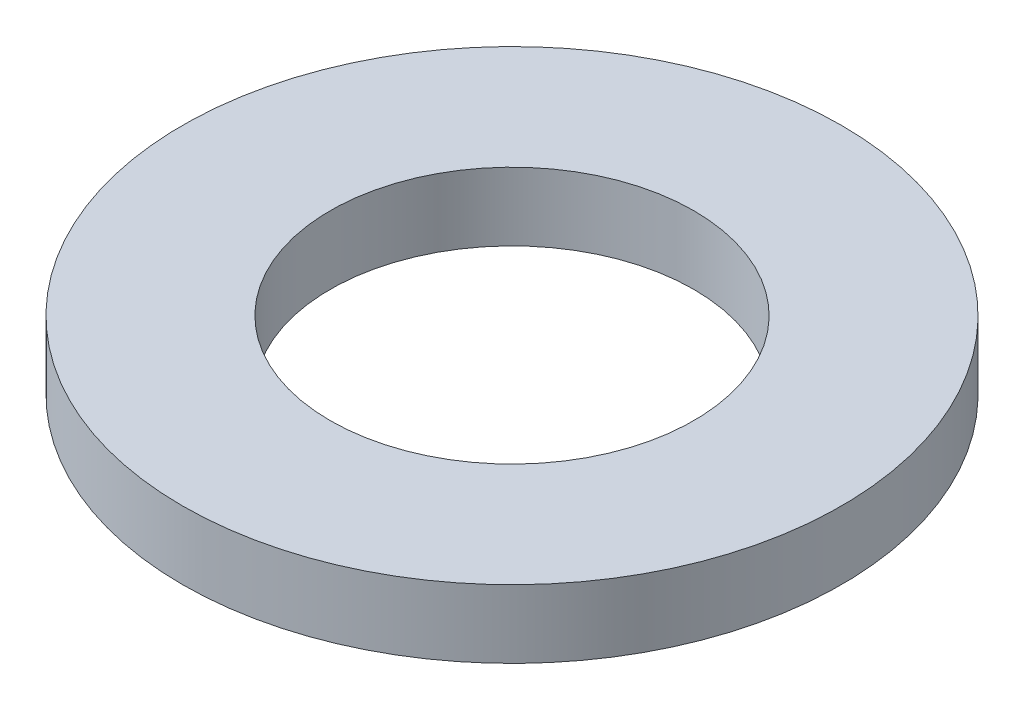
ISO-10303-21;
HEADER;
FILE_DESCRIPTION(('STEP AP214'),'2;1');
FILE_NAME('part.step','',(''),(''),'','','');
FILE_SCHEMA(('AUTOMOTIVE_DESIGN { 1 0 10303 214 1 1 1 1 }'));
ENDSEC;
DATA;
#1=APPLICATION_CONTEXT('core data for automotive mechanical design processes');
#2=APPLICATION_PROTOCOL_DEFINITION('international standard','automotive_design',2000,#1);
#3=PRODUCT_CONTEXT('',#1,'mechanical');
#4=PRODUCT('Part','Part','',(#3));
#5=PRODUCT_RELATED_PRODUCT_CATEGORY('part','',(#4));
#6=PRODUCT_DEFINITION_FORMATION('','',#4);
#7=PRODUCT_DEFINITION_CONTEXT('part definition',#1,'design');
#8=PRODUCT_DEFINITION('design','',#6,#7);
#9=PRODUCT_DEFINITION_SHAPE('','',#8);
#10=(LENGTH_UNIT() NAMED_UNIT(*) SI_UNIT(.MILLI.,.METRE.));
#11=(NAMED_UNIT(*) PLANE_ANGLE_UNIT() SI_UNIT($,.RADIAN.));
#12=(NAMED_UNIT(*) SI_UNIT($,.STERADIAN.) SOLID_ANGLE_UNIT());
#13=UNCERTAINTY_MEASURE_WITH_UNIT(LENGTH_MEASURE(1.E-05),#10,'distance_accuracy_value','');
#14=(GEOMETRIC_REPRESENTATION_CONTEXT(3) GLOBAL_UNCERTAINTY_ASSIGNED_CONTEXT((#13)) GLOBAL_UNIT_ASSIGNED_CONTEXT((#10,
#11,#12)) REPRESENTATION_CONTEXT('',''));
#15=CARTESIAN_POINT('',(0.,0.,0.));
#16=DIRECTION('',(0.,0.,1.));
#17=DIRECTION('',(1.,0.,0.));
#18=AXIS2_PLACEMENT_3D('',#15,#16,#17);
#19=CARTESIAN_POINT('',(0.,15.,0.));
#20=DIRECTION('',(0.,-1.,0.));
#21=DIRECTION('',(0.,0.,-1.));
#22=AXIS2_PLACEMENT_3D('',#19,#20,#21);
#23=CYLINDRICAL_SURFACE('',#22,72.5);
#24=CARTESIAN_POINT('',(0.,15.,0.));
#25=DIRECTION('',(0.,1.,0.));
#26=DIRECTION('',(0.,0.,1.));
#27=AXIS2_PLACEMENT_3D('',#24,#25,#26);
#28=CIRCLE('',#27,72.5);
#29=CARTESIAN_POINT('',(0.,15.,72.5));
#30=VERTEX_POINT('',#29);
#31=EDGE_CURVE('E10',#30,#30,#28,.T.);
#32=ORIENTED_EDGE('',*,*,#31,.F.);
#33=EDGE_LOOP('',(#32));
#34=FACE_BOUND('',#33,.T.);
#35=CARTESIAN_POINT('',(0.,0.,0.));
#36=DIRECTION('',(0.,1.,0.));
#37=DIRECTION('',(0.,0.,1.));
#38=AXIS2_PLACEMENT_3D('',#35,#36,#37);
#39=CIRCLE('',#38,72.5);
#40=CARTESIAN_POINT('',(0.,0.,72.5));
#41=VERTEX_POINT('',#40);
#42=EDGE_CURVE('E37',#41,#41,#39,.T.);
#43=ORIENTED_EDGE('',*,*,#42,.T.);
#44=EDGE_LOOP('',(#43));
#45=FACE_BOUND('',#44,.T.);
#46=ADVANCED_FACE('F40',(#34,#45),#23,.T.);
#47=CARTESIAN_POINT('',(0.,15.,0.));
#48=DIRECTION('',(0.,1.,0.));
#49=DIRECTION('',(0.,0.,1.));
#50=AXIS2_PLACEMENT_3D('',#47,#48,#49);
#51=PLANE('',#50);
#52=CARTESIAN_POINT('',(0.,15.,0.));
#53=DIRECTION('',(0.,1.,0.));
#54=DIRECTION('',(0.,0.,1.));
#55=AXIS2_PLACEMENT_3D('',#52,#53,#54);
#56=CIRCLE('',#55,40.);
#57=CARTESIAN_POINT('',(0.,15.,40.));
#58=VERTEX_POINT('',#57);
#59=EDGE_CURVE('E50',#58,#58,#56,.T.);
#60=ORIENTED_EDGE('',*,*,#59,.F.);
#61=EDGE_LOOP('',(#60));
#62=FACE_BOUND('',#61,.T.);
#63=ORIENTED_EDGE('',*,*,#31,.T.);
#64=EDGE_LOOP('',(#63));
#65=FACE_BOUND('',#64,.T.);
#66=ADVANCED_FACE('F59',(#62,#65),#51,.T.);
#67=CARTESIAN_POINT('',(0.,0.,0.));
#68=DIRECTION('',(0.,1.,0.));
#69=DIRECTION('',(0.,0.,1.));
#70=AXIS2_PLACEMENT_3D('',#67,#68,#69);
#71=PLANE('',#70);
#72=CARTESIAN_POINT('',(0.,0.,0.));
#73=DIRECTION('',(0.,1.,0.));
#74=DIRECTION('',(0.,0.,1.));
#75=AXIS2_PLACEMENT_3D('',#72,#73,#74);
#76=CIRCLE('',#75,40.);
#77=CARTESIAN_POINT('',(0.,0.,40.));
#78=VERTEX_POINT('',#77);
#79=EDGE_CURVE('E47',#78,#78,#76,.T.);
#80=ORIENTED_EDGE('',*,*,#79,.T.);
#81=EDGE_LOOP('',(#80));
#82=FACE_BOUND('',#81,.T.);
#83=ORIENTED_EDGE('',*,*,#42,.F.);
#84=EDGE_LOOP('',(#83));
#85=FACE_BOUND('',#84,.T.);
#86=ADVANCED_FACE('F58',(#82,#85),#71,.F.);
#87=CARTESIAN_POINT('',(0.,15.,0.));
#88=DIRECTION('',(0.,-1.,0.));
#89=DIRECTION('',(0.,0.,-1.));
#90=AXIS2_PLACEMENT_3D('',#87,#88,#89);
#91=CYLINDRICAL_SURFACE('',#90,40.);
#92=ORIENTED_EDGE('',*,*,#59,.T.);
#93=EDGE_LOOP('',(#92));
#94=FACE_BOUND('',#93,.T.);
#95=ORIENTED_EDGE('',*,*,#79,.F.);
#96=EDGE_LOOP('',(#95));
#97=FACE_BOUND('',#96,.T.);
#98=ADVANCED_FACE('F54',(#94,#97),#91,.F.);
#99=CLOSED_SHELL('',(#46,#66,#86,#98));
#100=MANIFOLD_SOLID_BREP('B2',#99);
#101=ADVANCED_BREP_SHAPE_REPRESENTATION('',(#18,#100),#14);
#102=SHAPE_DEFINITION_REPRESENTATION(#9,#101);
ENDSEC;
END-ISO-10303-21;
